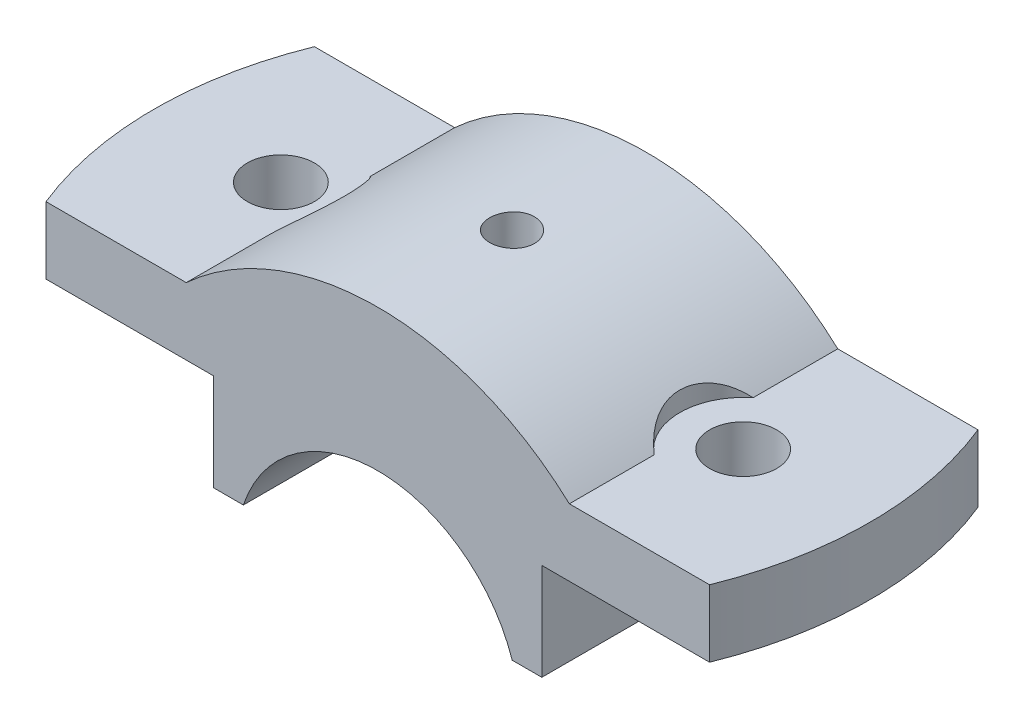
ISO-10303-21;
HEADER;
FILE_DESCRIPTION(('STEP AP214'),'2;1');
FILE_NAME('part.step','',(''),(''),'','','');
FILE_SCHEMA(('AUTOMOTIVE_DESIGN { 1 0 10303 214 1 1 1 1 }'));
ENDSEC;
DATA;
#1=APPLICATION_CONTEXT('core data for automotive mechanical design processes');
#2=APPLICATION_PROTOCOL_DEFINITION('international standard','automotive_design',2000,#1);
#3=PRODUCT_CONTEXT('',#1,'mechanical');
#4=PRODUCT('Part','Part','',(#3));
#5=PRODUCT_RELATED_PRODUCT_CATEGORY('part','',(#4));
#6=PRODUCT_DEFINITION_FORMATION('','',#4);
#7=PRODUCT_DEFINITION_CONTEXT('part definition',#1,'design');
#8=PRODUCT_DEFINITION('design','',#6,#7);
#9=PRODUCT_DEFINITION_SHAPE('','',#8);
#10=(LENGTH_UNIT() NAMED_UNIT(*) SI_UNIT(.MILLI.,.METRE.));
#11=(NAMED_UNIT(*) PLANE_ANGLE_UNIT() SI_UNIT($,.RADIAN.));
#12=(NAMED_UNIT(*) SI_UNIT($,.STERADIAN.) SOLID_ANGLE_UNIT());
#13=UNCERTAINTY_MEASURE_WITH_UNIT(LENGTH_MEASURE(1.E-05),#10,'distance_accuracy_value','');
#14=(GEOMETRIC_REPRESENTATION_CONTEXT(3) GLOBAL_UNCERTAINTY_ASSIGNED_CONTEXT((#13)) GLOBAL_UNIT_ASSIGNED_CONTEXT((#10,
#11,#12)) REPRESENTATION_CONTEXT('',''));
#15=CARTESIAN_POINT('',(0.,0.,0.));
#16=DIRECTION('',(0.,0.,1.));
#17=DIRECTION('',(1.,0.,0.));
#18=AXIS2_PLACEMENT_3D('',#15,#16,#17);
#19=CARTESIAN_POINT('',(0.,0.,18.));
#20=DIRECTION('',(0.,0.,-1.));
#21=DIRECTION('',(-1.,0.,0.));
#22=AXIS2_PLACEMENT_3D('',#19,#20,#21);
#23=CYLINDRICAL_SURFACE('',#22,38.);
#24=CARTESIAN_POINT('',(0.,38.,3.));
#25=CARTESIAN_POINT('',(-0.168230277437706,37.9999984430739,2.99999263868346));
#26=CARTESIAN_POINT('',(-0.336575845655095,37.9988709200709,2.98580169916932));
#27=CARTESIAN_POINT('',(-0.668611397196742,37.9944814128081,2.92939894930333));
#28=CARTESIAN_POINT('',(-0.832295850092009,37.9912169949172,2.88715518982943));
#29=CARTESIAN_POINT('',(-1.15015205512757,37.9829226863334,2.77587406357067));
#30=CARTESIAN_POINT('',(-1.3043290493551,37.9778937789402,2.70685161752221));
#31=CARTESIAN_POINT('',(-1.59887136159142,37.9666348413683,2.54399853963546));
#32=CARTESIAN_POINT('',(-1.73923967362019,37.9604050724332,2.45017330191646));
#33=CARTESIAN_POINT('',(-2.00254103126273,37.9474277075509,2.24014409327318));
#34=CARTESIAN_POINT('',(-2.12543792166293,37.9406790810774,2.1238948563935));
#35=CARTESIAN_POINT('',(-2.34999780988339,37.9274332919605,1.87241281605956));
#36=CARTESIAN_POINT('',(-2.45165988585508,37.9209361402441,1.73717918887838));
#37=CARTESIAN_POINT('',(-2.63098484586302,37.9089176287414,1.45135065682847));
#38=CARTESIAN_POINT('',(-2.708616254697,37.903397552738,1.30073594623714));
#39=CARTESIAN_POINT('',(-2.83747510230931,37.8939696224708,0.988558849059875));
#40=CARTESIAN_POINT('',(-2.8887029645124,37.8900617423529,0.82699663808231));
#41=CARTESIAN_POINT('',(-2.96319644645853,37.8843090780475,0.497870679819642));
#42=CARTESIAN_POINT('',(-2.98652059882487,37.8824599758018,0.33032025735777));
#43=CARTESIAN_POINT('',(-3.00472536931325,37.8810204867557,-0.00632681714998059));
#44=CARTESIAN_POINT('',(-2.99960647157769,37.8814300615093,-0.175423442828303));
#45=CARTESIAN_POINT('',(-2.96111886260011,37.8844577346025,-0.509962310035282));
#46=CARTESIAN_POINT('',(-2.92781369865023,37.8870708648728,-0.675411913710737));
#47=CARTESIAN_POINT('',(-2.83399765916122,37.8942034046858,-0.998365215123264));
#48=CARTESIAN_POINT('',(-2.77348654183749,37.8987228311701,-1.15586884222906));
#49=CARTESIAN_POINT('',(-2.62690490032728,37.9091644380148,-1.45866214971911));
#50=CARTESIAN_POINT('',(-2.54080579129679,37.9150881856644,-1.60393793599879));
#51=CARTESIAN_POINT('',(-2.34551283184452,37.9276694800349,-1.87799978791044));
#52=CARTESIAN_POINT('',(-2.23631856235736,37.9343270400699,-2.0067855542603));
#53=CARTESIAN_POINT('',(-1.99757813910437,37.947647885739,-2.24458115896057));
#54=CARTESIAN_POINT('',(-1.86797703439473,37.9543111370687,-2.35353583758634));
#55=CARTESIAN_POINT('',(-1.59229376436976,37.9668751419437,-2.54815019879117));
#56=CARTESIAN_POINT('',(-1.44621158946688,37.9727758950454,-2.63380986781872));
#57=CARTESIAN_POINT('',(-1.14167761997913,37.983150993084,-2.77939892547026));
#58=CARTESIAN_POINT('',(-0.983224692335488,37.9876252071703,-2.83932595392176));
#59=CARTESIAN_POINT('',(-0.658463212690176,37.9946415451888,-2.93171041942903));
#60=CARTESIAN_POINT('',(-0.492154807064346,37.997183705107,-2.96416836811962));
#61=CARTESIAN_POINT('',(-0.156881478742684,38.0000448768352,-3.00062434440681));
#62=CARTESIAN_POINT('',(0.0120751089608384,38.0003698415183,-3.00469857910482));
#63=CARTESIAN_POINT('',(0.348269003373999,37.9987758913175,-2.98447098943403));
#64=CARTESIAN_POINT('',(0.515506324442484,37.9968569951891,-2.96016940224689));
#65=CARTESIAN_POINT('',(0.843297753735755,37.9909950041868,-2.88394314979588));
#66=CARTESIAN_POINT('',(1.00386010671882,37.987054491835,-2.83205372367032));
#67=CARTESIAN_POINT('',(1.31399900365979,37.9775920824189,-2.70216068710782));
#68=CARTESIAN_POINT('',(1.46357539119334,37.9720701628431,-2.62415670492505));
#69=CARTESIAN_POINT('',(1.74784375041781,37.9600494395666,-2.44405671040129));
#70=CARTESIAN_POINT('',(1.88250358772923,37.953548595394,-2.34191011569745));
#71=CARTESIAN_POINT('',(2.13279217984117,37.9403075453845,-2.11649766051109));
#72=CARTESIAN_POINT('',(2.24842063776818,37.9335673358158,-1.99323147064187));
#73=CARTESIAN_POINT('',(2.45762484975141,37.9205896766453,-1.72874864835165));
#74=CARTESIAN_POINT('',(2.55115094155127,37.9143533795853,-1.58749266904679));
#75=CARTESIAN_POINT('',(2.713155238272,37.9031055627809,-1.29123629441747));
#76=CARTESIAN_POINT('',(2.78163367119924,37.8980940318878,-1.13623602422189));
#77=CARTESIAN_POINT('',(2.89151387110069,37.8898693720601,-0.817068099787168));
#78=CARTESIAN_POINT('',(2.93294623887224,37.8866542112497,-0.652911034998947));
#79=CARTESIAN_POINT('',(2.98765790023766,37.8823793491511,-0.319943850373173));
#80=CARTESIAN_POINT('',(3.00093767292138,37.8813196111828,-0.151133809767669));
#81=CARTESIAN_POINT('',(2.99896188688675,37.8814760426207,0.185853858942922));
#82=CARTESIAN_POINT('',(2.98378436644711,37.8826859878913,0.354031953001599));
#83=CARTESIAN_POINT('',(2.92548733876923,37.887232237977,0.68544287301911));
#84=CARTESIAN_POINT('',(2.8823677867555,37.8905685461995,0.848675691052988));
#85=CARTESIAN_POINT('',(2.7694300101543,37.8989899804525,1.16556899687011));
#86=CARTESIAN_POINT('',(2.69961296444521,37.9040750292632,1.31922990697071));
#87=CARTESIAN_POINT('',(2.535271096382,37.9154210711218,1.61266178094886));
#88=CARTESIAN_POINT('',(2.44074672054794,37.9216820429175,1.75243299578316));
#89=CARTESIAN_POINT('',(2.22938062382269,37.9346948182221,2.01451680288399));
#90=CARTESIAN_POINT('',(2.11248130954251,37.941447859921,2.13678288515433));
#91=CARTESIAN_POINT('',(1.85978424897896,37.954672635902,2.36000556130417));
#92=CARTESIAN_POINT('',(1.72398192526551,37.9611443015481,2.46095697881558));
#93=CARTESIAN_POINT('',(1.43709756450133,37.9730876131211,2.63880542567551));
#94=CARTESIAN_POINT('',(1.2859897583193,37.978557527474,2.71566096437293));
#95=CARTESIAN_POINT('',(0.973076064569829,37.9878601967286,2.8428120018995));
#96=CARTESIAN_POINT('',(0.811282773093929,37.9916948408735,2.89313816633252));
#97=CARTESIAN_POINT('',(0.540438770546244,37.9963056825779,2.95292296572034));
#98=CARTESIAN_POINT('',(0.433132098217287,37.9976847801056,2.97055353917028));
#99=CARTESIAN_POINT('',(0.217232975456249,37.9995324404705,2.99409441950641));
#100=CARTESIAN_POINT('',(0.108640528034262,38.0000010054389,3.0000047538251));
#101=CARTESIAN_POINT('',(0.,38.,3.));
#102=B_SPLINE_CURVE_WITH_KNOTS('',3,(#24,#25,#26,#27,#28,#29,#30,#31,#32,#33,#34,#35,#36,#37,
#38,#39,#40,#41,#42,#43,#44,#45,#46,#47,#48,#49,#50,#51,#52,#53,#54,#55,#56,#57,#58,#59,#60,#61,
#62,#63,#64,#65,#66,#67,#68,#69,#70,#71,#72,#73,#74,#75,#76,#77,#78,#79,#80,#81,#82,#83,#84,#85,
#86,#87,#88,#89,#90,#91,#92,#93,#94,#95,#96,#97,#98,#99,#100,#101),.UNSPECIFIED.,.T.,.F.,(4,2,2,
2,2,2,2,2,2,2,2,2,2,2,2,2,2,2,2,2,2,2,2,2,2,2,2,2,2,2,2,2,2,2,2,2,2,2,4),(0.,0.504294188546741,
1.00916370078726,1.51375230936014,2.01823126998903,2.5237394549149,3.0292695804704,
3.53545907123702,4.04164044416132,4.54675814609821,5.05186725021795,5.55584058602808,
6.05981840083593,6.56436134901272,7.06891345298728,7.57484819748388,8.0807832362998,
8.58676466907349,9.09273667730812,9.59734968185781,10.1019584685879,10.6059242398502,
11.1098971854695,11.614935538604,12.1199817691652,12.6261522324058,13.1323180879118,
13.6379102536977,14.1434938154447,14.6476929456065,15.1518928837201,15.6560705605014,
16.1602391262259,16.6657233184336,17.1713301290485,17.6778028214878,18.183688785524,
18.5093549854356,18.8350204230892),.UNSPECIFIED.);
#103=CARTESIAN_POINT('',(0.,38.,3.));
#104=VERTEX_POINT('',#103);
#105=EDGE_CURVE('E11',#104,#104,#102,.T.);
#106=ORIENTED_EDGE('',*,*,#105,.T.);
#107=EDGE_LOOP('',(#106));
#108=FACE_BOUND('',#107,.T.);
#109=DIRECTION('',(0.,0.,-1.));
#110=VECTOR('',#109,1.);
#111=CARTESIAN_POINT('',(25.6904651573303,28.,18.));
#112=LINE('',#111,#110);
#113=CARTESIAN_POINT('',(25.6904651573303,28.,18.));
#114=VERTEX_POINT('',#113);
#115=CARTESIAN_POINT('',(25.6904651573303,28.,6.6376833123068));
#116=VERTEX_POINT('',#115);
#117=EDGE_CURVE('E148',#114,#116,#112,.T.);
#118=ORIENTED_EDGE('',*,*,#117,.T.);
#119=CARTESIAN_POINT('',(25.6904651573303,28.,6.63768331230679));
#120=CARTESIAN_POINT('',(25.5360851043424,28.1416681018721,6.51420867249737));
#121=CARTESIAN_POINT('',(25.3836215551735,28.2791823336498,6.38340380017068));
#122=CARTESIAN_POINT('',(25.0841053598261,28.5451833866574,6.10685950724571));
#123=CARTESIAN_POINT('',(24.9370580895264,28.6736613482156,5.96110576476093));
#124=CARTESIAN_POINT('',(24.6491941230388,28.9215085426632,5.653491442262));
#125=CARTESIAN_POINT('',(24.508431723833,29.0408031542341,5.49151942353939));
#126=CARTESIAN_POINT('',(24.2363075607749,29.2682904084011,5.15263687836669));
#127=CARTESIAN_POINT('',(24.1049430857226,29.3764862568107,4.97573069263072));
#128=CARTESIAN_POINT('',(23.8528205053459,29.5815743674557,4.60631493821573));
#129=CARTESIAN_POINT('',(23.7321338833277,29.6783916917415,4.41371469093335));
#130=CARTESIAN_POINT('',(23.5043908446779,29.85908164754,4.01479632179465));
#131=CARTESIAN_POINT('',(23.3973358972541,29.942952883943,3.8084767249227));
#132=CARTESIAN_POINT('',(23.1992536300817,30.0966827286364,3.38422419101505));
#133=CARTESIAN_POINT('',(23.1081729651955,30.1665880882949,3.16633319991271));
#134=CARTESIAN_POINT('',(22.9434688496595,30.2920447623401,2.72008092153075));
#135=CARTESIAN_POINT('',(22.869842066784,30.347598816803,2.49172164276594));
#136=CARTESIAN_POINT('',(22.7499342032063,30.4375648556656,2.05682098381957));
#137=CARTESIAN_POINT('',(22.7013462567531,30.4737833576563,1.85128534823192));
#138=CARTESIAN_POINT('',(22.6194172898017,30.534645499234,1.43551725204116));
#139=CARTESIAN_POINT('',(22.5860747992536,30.5592902548309,1.22528524633892));
#140=CARTESIAN_POINT('',(22.5352129551669,30.5968164834569,0.801799591498537));
#141=CARTESIAN_POINT('',(22.5176992505084,30.6096937569973,0.588544891193931));
#142=CARTESIAN_POINT('',(22.4988301660851,30.6235658271181,0.160939560666244));
#143=CARTESIAN_POINT('',(22.4974739036633,30.624561272785,-0.0534110090511235));
#144=CARTESIAN_POINT('',(22.5103301119086,30.6151119876343,-0.46199747981814));
#145=CARTESIAN_POINT('',(22.5231488228924,30.6056914251709,-0.656303160135766));
#146=CARTESIAN_POINT('',(22.5619809221014,30.5770763766543,-1.0428625929884));
#147=CARTESIAN_POINT('',(22.5879939672906,30.5578821447042,-1.23511639873687));
#148=CARTESIAN_POINT('',(22.6528192304938,30.5098574663833,-1.61613906729808));
#149=CARTESIAN_POINT('',(22.6916259266854,30.4810311771979,-1.80490939654948));
#150=CARTESIAN_POINT('',(22.7814851533843,30.4139289484325,-2.17779604427593));
#151=CARTESIAN_POINT('',(22.8325379785097,30.3756527815061,-2.36191225066402));
#152=CARTESIAN_POINT('',(22.9463727274414,30.2897519777021,-2.72495933677602));
#153=CARTESIAN_POINT('',(23.0091940590921,30.2420959034169,-2.90387039063446));
#154=CARTESIAN_POINT('',(23.1456283742011,30.1378044455698,-3.25489148863349));
#155=CARTESIAN_POINT('',(23.2192449894415,30.0811660396201,-3.42699921914349));
#156=CARTESIAN_POINT('',(23.3763137314078,29.9592695660632,-3.76349373210636));
#157=CARTESIAN_POINT('',(23.4597660818508,29.8940113023904,-3.92788033882065));
#158=CARTESIAN_POINT('',(23.635527045378,29.7552415450916,-4.24828704232642));
#159=CARTESIAN_POINT('',(23.7278387953854,29.6817271265587,-4.40430414494655));
#160=CARTESIAN_POINT('',(23.9282386479047,29.5204551498758,-4.71995510834891));
#161=CARTESIAN_POINT('',(24.0370002176616,29.432022004933,-4.87881602386905));
#162=CARTESIAN_POINT('',(24.2623844714665,29.2465042091278,-5.1856332961988));
#163=CARTESIAN_POINT('',(24.379010630913,29.1494157272481,-5.33358477081362));
#164=CARTESIAN_POINT('',(24.6187042069683,28.9472618083659,-5.61815393006346));
#165=CARTESIAN_POINT('',(24.7417672458198,28.8422017715012,-5.75477915839727));
#166=CARTESIAN_POINT('',(24.9931857635632,28.6246099475779,-6.016738259449));
#167=CARTESIAN_POINT('',(25.121541230047,28.5120781780363,-6.14207215863704));
#168=CARTESIAN_POINT('',(25.3239635142993,28.3320696328102,-6.32788833390874));
#169=CARTESIAN_POINT('',(25.3966039536003,28.2669811541268,-6.39227987552885));
#170=CARTESIAN_POINT('',(25.5428336292653,28.1349133065772,-6.5175597465675));
#171=CARTESIAN_POINT('',(25.6164208573994,28.0679376662269,-6.57845434819236));
#172=CARTESIAN_POINT('',(25.6904651573302,28.0000000000002,-6.63768331230706));
#173=B_SPLINE_CURVE_WITH_KNOTS('',3,(#119,#120,#121,#122,#123,#124,#125,#126,#127,#128,#129,
#130,#131,#132,#133,#134,#135,#136,#137,#138,#139,#140,#141,#142,#143,#144,#145,#146,#147,#148,
#149,#150,#151,#152,#153,#154,#155,#156,#157,#158,#159,#160,#161,#162,#163,#164,#165,#166,#167,
#168,#169,#170,#171,#172),.UNSPECIFIED.,.F.,.F.,(4,2,2,2,2,2,2,2,2,2,2,2,2,2,2,2,2,2,2,2,2,2,2,
2,2,2,4),(0.,0.729592400834073,1.45989044138352,2.19560470883999,2.93110586753775,
3.67120763552798,4.41138910352643,5.14904966030397,5.8865692722368,6.52855006409985,
7.17046893961489,7.8126168088522,8.45472959834446,9.03890309081732,9.62306139629814,
10.2069679046447,10.7908884620571,11.3768004587137,11.9629100238154,12.549032922753,
13.1353641263273,13.7703169673958,14.4055522594533,15.040361004022,15.6751682603777,
16.0257258218313,16.3756336015193),.UNSPECIFIED.);
#174=CARTESIAN_POINT('',(25.6904651573303,28.,-6.6376833123068));
#175=VERTEX_POINT('',#174);
#176=EDGE_CURVE('E140',#116,#175,#173,.T.);
#177=ORIENTED_EDGE('',*,*,#176,.T.);
#178=CARTESIAN_POINT('',(25.6904651573303,28.,-18.));
#179=VERTEX_POINT('',#178);
#180=EDGE_CURVE('E145',#175,#179,#112,.T.);
#181=ORIENTED_EDGE('',*,*,#180,.T.);
#182=CARTESIAN_POINT('',(0.,0.,-18.));
#183=DIRECTION('',(0.,0.,1.));
#184=DIRECTION('',(1.,0.,0.));
#185=AXIS2_PLACEMENT_3D('',#182,#183,#184);
#186=CIRCLE('',#185,38.);
#187=CARTESIAN_POINT('',(-25.6904651573303,28.,-18.));
#188=VERTEX_POINT('',#187);
#189=EDGE_CURVE('E249',#179,#188,#186,.T.);
#190=ORIENTED_EDGE('',*,*,#189,.T.);
#191=DIRECTION('',(0.,0.,-1.));
#192=VECTOR('',#191,1.);
#193=CARTESIAN_POINT('',(-25.6904651573303,28.,18.));
#194=LINE('',#193,#192);
#195=CARTESIAN_POINT('',(-25.6904651573303,28.,-6.63768331230679));
#196=VERTEX_POINT('',#195);
#197=EDGE_CURVE('E182',#196,#188,#194,.T.);
#198=ORIENTED_EDGE('',*,*,#197,.F.);
#199=CARTESIAN_POINT('',(-25.6904651573303,28.,6.63768331230679));
#200=CARTESIAN_POINT('',(-25.5360851043424,28.1416681018721,6.51420867249737));
#201=CARTESIAN_POINT('',(-25.3836215551735,28.2791823336498,6.38340380017068));
#202=CARTESIAN_POINT('',(-25.0841053598261,28.5451833866574,6.10685950724571));
#203=CARTESIAN_POINT('',(-24.9370580895264,28.6736613482156,5.96110576476093));
#204=CARTESIAN_POINT('',(-24.6491941230388,28.9215085426632,5.653491442262));
#205=CARTESIAN_POINT('',(-24.508431723833,29.0408031542341,5.49151942353939));
#206=CARTESIAN_POINT('',(-24.2363075607749,29.2682904084011,5.1526368783667));
#207=CARTESIAN_POINT('',(-24.1049430857226,29.3764862568107,4.97573069263072));
#208=CARTESIAN_POINT('',(-23.8528205053459,29.5815743674557,4.60631493821573));
#209=CARTESIAN_POINT('',(-23.7321338833277,29.6783916917415,4.41371469093334));
#210=CARTESIAN_POINT('',(-23.5043908446779,29.85908164754,4.01479632179465));
#211=CARTESIAN_POINT('',(-23.3973358972541,29.942952883943,3.8084767249227));
#212=CARTESIAN_POINT('',(-23.1992536300817,30.0966827286364,3.38422419101505));
#213=CARTESIAN_POINT('',(-23.1081729651955,30.1665880882949,3.16633319991271));
#214=CARTESIAN_POINT('',(-22.9434688496595,30.2920447623401,2.72008092153075));
#215=CARTESIAN_POINT('',(-22.869842066784,30.347598816803,2.49172164276594));
#216=CARTESIAN_POINT('',(-22.7499342032063,30.4375648556656,2.05682098381957));
#217=CARTESIAN_POINT('',(-22.7013462567531,30.4737833576563,1.85128534823192));
#218=CARTESIAN_POINT('',(-22.6194172898017,30.534645499234,1.43551725204116));
#219=CARTESIAN_POINT('',(-22.5860747992536,30.5592902548309,1.22528524633892));
#220=CARTESIAN_POINT('',(-22.5352129551669,30.5968164834569,0.801799591498539));
#221=CARTESIAN_POINT('',(-22.5176992505084,30.6096937569973,0.588544891193933));
#222=CARTESIAN_POINT('',(-22.4988301660851,30.6235658271181,0.160939560666246));
#223=CARTESIAN_POINT('',(-22.4974739036633,30.624561272785,-0.0534110090511212));
#224=CARTESIAN_POINT('',(-22.5103301119086,30.6151119876343,-0.461997479818138));
#225=CARTESIAN_POINT('',(-22.5231488228924,30.6056914251709,-0.656303160135765));
#226=CARTESIAN_POINT('',(-22.5619809221014,30.5770763766543,-1.0428625929884));
#227=CARTESIAN_POINT('',(-22.5879939672906,30.5578821447042,-1.23511639873687));
#228=CARTESIAN_POINT('',(-22.6528192304938,30.5098574663833,-1.61613906729808));
#229=CARTESIAN_POINT('',(-22.6916259266854,30.4810311771979,-1.80490939654947));
#230=CARTESIAN_POINT('',(-22.7814851533843,30.4139289484325,-2.17779604427593));
#231=CARTESIAN_POINT('',(-22.8325379785097,30.3756527815061,-2.36191225066402));
#232=CARTESIAN_POINT('',(-22.9463727274414,30.2897519777021,-2.72495933677602));
#233=CARTESIAN_POINT('',(-23.0091940590921,30.2420959034169,-2.90387039063446));
#234=CARTESIAN_POINT('',(-23.1456283742011,30.1378044455698,-3.25489148863349));
#235=CARTESIAN_POINT('',(-23.2192449894415,30.0811660396201,-3.42699921914349));
#236=CARTESIAN_POINT('',(-23.3763137314078,29.9592695660632,-3.76349373210635));
#237=CARTESIAN_POINT('',(-23.4597660818508,29.8940113023904,-3.92788033882065));
#238=CARTESIAN_POINT('',(-23.635527045378,29.7552415450916,-4.24828704232642));
#239=CARTESIAN_POINT('',(-23.7278387953854,29.6817271265587,-4.40430414494654));
#240=CARTESIAN_POINT('',(-23.9282386479047,29.5204551498758,-4.71995510834891));
#241=CARTESIAN_POINT('',(-24.0370002176616,29.432022004933,-4.87881602386905));
#242=CARTESIAN_POINT('',(-24.2623844714665,29.2465042091278,-5.18563329619879));
#243=CARTESIAN_POINT('',(-24.379010630913,29.1494157272481,-5.33358477081362));
#244=CARTESIAN_POINT('',(-24.6187042069683,28.9472618083659,-5.61815393006346));
#245=CARTESIAN_POINT('',(-24.7417672458198,28.8422017715012,-5.75477915839727));
#246=CARTESIAN_POINT('',(-24.9931857635632,28.6246099475779,-6.01673825944899));
#247=CARTESIAN_POINT('',(-25.121541230047,28.5120781780363,-6.14207215863704));
#248=CARTESIAN_POINT('',(-25.3239635142993,28.3320696328102,-6.32788833390874));
#249=CARTESIAN_POINT('',(-25.3966039536003,28.2669811541268,-6.39227987552885));
#250=CARTESIAN_POINT('',(-25.5428336292653,28.1349133065772,-6.5175597465675));
#251=CARTESIAN_POINT('',(-25.6164208573994,28.0679376662269,-6.57845434819236));
#252=CARTESIAN_POINT('',(-25.6904651573302,28.0000000000002,-6.63768331230706));
#253=B_SPLINE_CURVE_WITH_KNOTS('',3,(#199,#200,#201,#202,#203,#204,#205,#206,#207,#208,#209,
#210,#211,#212,#213,#214,#215,#216,#217,#218,#219,#220,#221,#222,#223,#224,#225,#226,#227,#228,
#229,#230,#231,#232,#233,#234,#235,#236,#237,#238,#239,#240,#241,#242,#243,#244,#245,#246,#247,
#248,#249,#250,#251,#252),.UNSPECIFIED.,.F.,.F.,(4,2,2,2,2,2,2,2,2,2,2,2,2,2,2,2,2,2,2,2,2,2,2,
2,2,2,4),(0.,0.729592400834073,1.45989044138352,2.19560470883998,2.93110586753775,
3.67120763552798,4.41138910352643,5.14904966030397,5.8865692722368,6.52855006409984,
7.17046893961489,7.8126168088522,8.45472959834445,9.03890309081732,9.62306139629814,
10.2069679046447,10.7908884620571,11.3768004587137,11.9629100238154,12.549032922753,
13.1353641263273,13.7703169673958,14.4055522594533,15.040361004022,15.6751682603777,
16.0257258218313,16.3756336015193),.UNSPECIFIED.);
#254=CARTESIAN_POINT('',(-25.6904651573303,28.,6.63768331230679));
#255=VERTEX_POINT('',#254);
#256=EDGE_CURVE('E220',#255,#196,#253,.T.);
#257=ORIENTED_EDGE('',*,*,#256,.F.);
#258=CARTESIAN_POINT('',(-25.6904651573303,28.,18.));
#259=VERTEX_POINT('',#258);
#260=EDGE_CURVE('E183',#259,#255,#194,.T.);
#261=ORIENTED_EDGE('',*,*,#260,.F.);
#262=CARTESIAN_POINT('',(0.,0.,18.));
#263=DIRECTION('',(0.,0.,1.));
#264=DIRECTION('',(1.,0.,0.));
#265=AXIS2_PLACEMENT_3D('',#262,#263,#264);
#266=CIRCLE('',#265,38.);
#267=EDGE_CURVE('E250',#114,#259,#266,.T.);
#268=ORIENTED_EDGE('',*,*,#267,.F.);
#269=EDGE_LOOP('',(#118,#177,#181,#190,#198,#257,#261,#268));
#270=FACE_BOUND('',#269,.T.);
#271=ADVANCED_FACE('F33',(#108,#270),#23,.T.);
#272=CARTESIAN_POINT('',(-50.,28.,18.));
#273=DIRECTION('',(0.,-1.,0.));
#274=DIRECTION('',(1.,0.,0.));
#275=AXIS2_PLACEMENT_3D('',#272,#273,#274);
#276=PLANE('',#275);
#277=ORIENTED_EDGE('',*,*,#260,.T.);
#278=CARTESIAN_POINT('',(-31.,28.,0.));
#279=DIRECTION('',(0.,1.,0.));
#280=DIRECTION('',(-1.,0.,0.));
#281=AXIS2_PLACEMENT_3D('',#278,#279,#280);
#282=CIRCLE('',#281,8.5);
#283=EDGE_CURVE('E61',#255,#196,#282,.T.);
#284=ORIENTED_EDGE('',*,*,#283,.T.);
#285=ORIENTED_EDGE('',*,*,#197,.T.);
#286=DIRECTION('',(-1.,0.,0.));
#287=VECTOR('',#286,1.);
#288=CARTESIAN_POINT('',(-50.,28.,-18.));
#289=LINE('',#288,#287);
#290=CARTESIAN_POINT('',(-44.497190922574,28.,-18.));
#291=VERTEX_POINT('',#290);
#292=EDGE_CURVE('E271',#188,#291,#289,.T.);
#293=ORIENTED_EDGE('',*,*,#292,.T.);
#294=CARTESIAN_POINT('',(0.,28.,0.));
#295=DIRECTION('',(0.,-1.,0.));
#296=DIRECTION('',(-1.,0.,0.));
#297=AXIS2_PLACEMENT_3D('',#294,#295,#296);
#298=CIRCLE('',#297,48.);
#299=CARTESIAN_POINT('',(-44.497190922574,28.,18.));
#300=VERTEX_POINT('',#299);
#301=EDGE_CURVE('E242',#300,#291,#298,.T.);
#302=ORIENTED_EDGE('',*,*,#301,.F.);
#303=DIRECTION('',(-1.,0.,0.));
#304=VECTOR('',#303,1.);
#305=CARTESIAN_POINT('',(-50.,28.,18.));
#306=LINE('',#305,#304);
#307=EDGE_CURVE('E253',#259,#300,#306,.T.);
#308=ORIENTED_EDGE('',*,*,#307,.F.);
#309=EDGE_LOOP('',(#277,#284,#285,#293,#302,#308));
#310=FACE_BOUND('',#309,.T.);
#311=CARTESIAN_POINT('',(-31.,28.,0.));
#312=DIRECTION('',(0.,1.,0.));
#313=DIRECTION('',(-1.,0.,0.));
#314=AXIS2_PLACEMENT_3D('',#311,#312,#313);
#315=CIRCLE('',#314,4.5);
#316=CARTESIAN_POINT('',(-35.5,28.,0.));
#317=VERTEX_POINT('',#316);
#318=EDGE_CURVE('E193',#317,#317,#315,.T.);
#319=ORIENTED_EDGE('',*,*,#318,.F.);
#320=EDGE_LOOP('',(#319));
#321=FACE_BOUND('',#320,.T.);
#322=ADVANCED_FACE('F334',(#310,#321),#276,.F.);
#323=CARTESIAN_POINT('',(-22.,19.,18.));
#324=DIRECTION('',(0.,1.,0.));
#325=DIRECTION('',(-1.,0.,0.));
#326=AXIS2_PLACEMENT_3D('',#323,#324,#325);
#327=PLANE('',#326);
#328=CARTESIAN_POINT('',(-31.,19.,0.));
#329=DIRECTION('',(0.,1.,0.));
#330=DIRECTION('',(-1.,0.,0.));
#331=AXIS2_PLACEMENT_3D('',#328,#329,#330);
#332=CIRCLE('',#331,4.5);
#333=CARTESIAN_POINT('',(-35.5,19.,0.));
#334=VERTEX_POINT('',#333);
#335=EDGE_CURVE('E190',#334,#334,#332,.T.);
#336=ORIENTED_EDGE('',*,*,#335,.T.);
#337=EDGE_LOOP('',(#336));
#338=FACE_BOUND('',#337,.T.);
#339=DIRECTION('',(1.,0.,0.));
#340=VECTOR('',#339,1.);
#341=CARTESIAN_POINT('',(-22.,19.,18.));
#342=LINE('',#341,#340);
#343=CARTESIAN_POINT('',(-44.497190922574,19.,18.));
#344=VERTEX_POINT('',#343);
#345=CARTESIAN_POINT('',(-22.,19.,18.));
#346=VERTEX_POINT('',#345);
#347=EDGE_CURVE('E256',#344,#346,#342,.T.);
#348=ORIENTED_EDGE('',*,*,#347,.F.);
#349=CARTESIAN_POINT('',(0.,19.,0.));
#350=DIRECTION('',(0.,1.,0.));
#351=DIRECTION('',(-1.,0.,0.));
#352=AXIS2_PLACEMENT_3D('',#349,#350,#351);
#353=CIRCLE('',#352,48.);
#354=CARTESIAN_POINT('',(-44.497190922574,19.,-18.));
#355=VERTEX_POINT('',#354);
#356=EDGE_CURVE('E246',#344,#355,#353,.F.);
#357=ORIENTED_EDGE('',*,*,#356,.T.);
#358=DIRECTION('',(1.,0.,0.));
#359=VECTOR('',#358,1.);
#360=CARTESIAN_POINT('',(-22.,19.,-18.));
#361=LINE('',#360,#359);
#362=CARTESIAN_POINT('',(-22.,19.,-18.));
#363=VERTEX_POINT('',#362);
#364=EDGE_CURVE('E274',#355,#363,#361,.T.);
#365=ORIENTED_EDGE('',*,*,#364,.T.);
#366=DIRECTION('',(0.,0.,-1.));
#367=VECTOR('',#366,1.);
#368=CARTESIAN_POINT('',(-22.,19.,18.));
#369=LINE('',#368,#367);
#370=EDGE_CURVE('E179',#346,#363,#369,.T.);
#371=ORIENTED_EDGE('',*,*,#370,.F.);
#372=EDGE_LOOP('',(#348,#357,#365,#371));
#373=FACE_BOUND('',#372,.T.);
#374=ADVANCED_FACE('F329',(#338,#373),#327,.F.);
#375=CARTESIAN_POINT('',(-22.,5.99999999999999,18.));
#376=DIRECTION('',(1.,0.,0.));
#377=DIRECTION('',(0.,0.,-1.));
#378=AXIS2_PLACEMENT_3D('',#375,#376,#377);
#379=PLANE('',#378);
#380=DIRECTION('',(0.,-1.,0.));
#381=VECTOR('',#380,1.);
#382=CARTESIAN_POINT('',(-22.,5.99999999999999,-18.));
#383=LINE('',#382,#381);
#384=CARTESIAN_POINT('',(-22.,5.99999999999999,-18.));
#385=VERTEX_POINT('',#384);
#386=EDGE_CURVE('E276',#363,#385,#383,.T.);
#387=ORIENTED_EDGE('',*,*,#386,.T.);
#388=DIRECTION('',(0.,0.,-1.));
#389=VECTOR('',#388,1.);
#390=CARTESIAN_POINT('',(-22.,5.99999999999999,18.));
#391=LINE('',#390,#389);
#392=CARTESIAN_POINT('',(-22.,5.99999999999999,18.));
#393=VERTEX_POINT('',#392);
#394=EDGE_CURVE('E176',#393,#385,#391,.T.);
#395=ORIENTED_EDGE('',*,*,#394,.F.);
#396=DIRECTION('',(0.,-1.,0.));
#397=VECTOR('',#396,1.);
#398=CARTESIAN_POINT('',(-22.,5.99999999999999,18.));
#399=LINE('',#398,#397);
#400=EDGE_CURVE('E258',#346,#393,#399,.T.);
#401=ORIENTED_EDGE('',*,*,#400,.F.);
#402=ORIENTED_EDGE('',*,*,#370,.T.);
#403=EDGE_LOOP('',(#387,#395,#401,#402));
#404=FACE_BOUND('',#403,.T.);
#405=ADVANCED_FACE('F323',(#404),#379,.F.);
#406=CARTESIAN_POINT('',(-22.,5.99999999999999,18.));
#407=DIRECTION('',(0.,1.,0.));
#408=DIRECTION('',(-1.,0.,0.));
#409=AXIS2_PLACEMENT_3D('',#406,#407,#408);
#410=PLANE('',#409);
#411=DIRECTION('',(1.,0.,0.));
#412=VECTOR('',#411,1.);
#413=CARTESIAN_POINT('',(-22.,5.99999999999999,-18.));
#414=LINE('',#413,#412);
#415=CARTESIAN_POINT('',(-18.0277563773199,6.,-18.));
#416=VERTEX_POINT('',#415);
#417=EDGE_CURVE('E278',#385,#416,#414,.T.);
#418=ORIENTED_EDGE('',*,*,#417,.T.);
#419=DIRECTION('',(0.,0.,-1.));
#420=VECTOR('',#419,1.);
#421=CARTESIAN_POINT('',(-18.0277563773199,6.,18.));
#422=LINE('',#421,#420);
#423=CARTESIAN_POINT('',(-18.0277563773199,6.,18.));
#424=VERTEX_POINT('',#423);
#425=EDGE_CURVE('E173',#424,#416,#422,.T.);
#426=ORIENTED_EDGE('',*,*,#425,.F.);
#427=DIRECTION('',(1.,0.,0.));
#428=VECTOR('',#427,1.);
#429=CARTESIAN_POINT('',(-22.,5.99999999999999,18.));
#430=LINE('',#429,#428);
#431=EDGE_CURVE('E260',#393,#424,#430,.T.);
#432=ORIENTED_EDGE('',*,*,#431,.F.);
#433=ORIENTED_EDGE('',*,*,#394,.T.);
#434=EDGE_LOOP('',(#418,#426,#432,#433));
#435=FACE_BOUND('',#434,.T.);
#436=ADVANCED_FACE('F319',(#435),#410,.F.);
#437=CARTESIAN_POINT('',(0.,0.,18.));
#438=DIRECTION('',(0.,0.,-1.));
#439=DIRECTION('',(-1.,0.,0.));
#440=AXIS2_PLACEMENT_3D('',#437,#438,#439);
#441=CYLINDRICAL_SURFACE('',#440,19.);
#442=CARTESIAN_POINT('',(0.,19.,2.49999999999999));
#443=CARTESIAN_POINT('',(0.139778315489381,18.999997967774,2.49999410094607));
#444=CARTESIAN_POINT('',(0.279642447495432,18.9984412683557,2.48823767475851));
#445=CARTESIAN_POINT('',(0.555474474016764,18.9923810422329,2.44152700403634));
#446=CARTESIAN_POINT('',(0.691438217949602,18.9878744896332,2.40654893872552));
#447=CARTESIAN_POINT('',(0.955436642925262,18.9764219373405,2.31444705906101));
#448=CARTESIAN_POINT('',(1.08347675216936,18.9694776299244,2.25733860465933));
#449=CARTESIAN_POINT('',(1.32813277832855,18.9539206812215,2.12263165454414));
#450=CARTESIAN_POINT('',(1.44475055826477,18.9453083126858,2.04503650793576));
#451=CARTESIAN_POINT('',(1.66398308687909,18.9273173646443,1.87105538112386));
#452=CARTESIAN_POINT('',(1.76651843289981,18.9179348817316,1.77456973952705));
#453=CARTESIAN_POINT('',(1.95399133146886,18.8994924119599,1.56576064733009));
#454=CARTESIAN_POINT('',(2.0389279601093,18.890432442053,1.4534363657436));
#455=CARTESIAN_POINT('',(2.18909162338547,18.8736225658863,1.21561789849417));
#456=CARTESIAN_POINT('',(2.254243636291,18.8658776941045,1.09007595594652));
#457=CARTESIAN_POINT('',(2.36250946256607,18.8526269269547,0.82971330966885));
#458=CARTESIAN_POINT('',(2.40562420041089,18.8471209376663,0.694892995440666));
#459=CARTESIAN_POINT('',(2.46834893112872,18.8390089488849,0.420627771177584));
#460=CARTESIAN_POINT('',(2.48809350572304,18.8363863510935,0.281214139706503));
#461=CARTESIAN_POINT('',(2.50393399543624,18.8342874081065,0.0010294214537408));
#462=CARTESIAN_POINT('',(2.50003096100306,18.8348109231579,-0.139741604753913));
#463=CARTESIAN_POINT('',(2.46879737750757,18.8389298660036,-0.417704097944482));
#464=CARTESIAN_POINT('',(2.44161547626707,18.8425058020086,-0.554912597936804));
#465=CARTESIAN_POINT('',(2.36482786882149,18.852296258763,-0.822803762753464));
#466=CARTESIAN_POINT('',(2.31522166359116,18.8585108382319,-0.95348628227828));
#467=CARTESIAN_POINT('',(2.19483509097755,18.8729003199956,-1.20507533515602));
#468=CARTESIAN_POINT('',(2.12399053069557,18.8810811502029,-1.3259507990106));
#469=CARTESIAN_POINT('',(1.96318413435717,18.8984768576706,-1.55415393130079));
#470=CARTESIAN_POINT('',(1.87322133002782,18.9076917872934,-1.66148091311362));
#471=CARTESIAN_POINT('',(1.67591027855668,18.9262039286229,-1.8604029509214));
#472=CARTESIAN_POINT('',(1.5684339827901,18.9355012293485,-1.95187103488117));
#473=CARTESIAN_POINT('',(1.33958658891131,18.9530645440151,-2.11548884034055));
#474=CARTESIAN_POINT('',(1.21821545257772,18.9613305551191,-2.18763850869799));
#475=CARTESIAN_POINT('',(0.964922757293814,18.9759058695861,-2.31057308687671));
#476=CARTESIAN_POINT('',(0.832997072631037,18.9822144030351,-2.36134959301125));
#477=CARTESIAN_POINT('',(0.562390331231886,18.9921571388022,-2.43999334343768));
#478=CARTESIAN_POINT('',(0.423709625549348,18.9957914799383,-2.4678617769038));
#479=CARTESIAN_POINT('',(0.144626841595052,18.9999582136113,-2.49973268466772));
#480=CARTESIAN_POINT('',(0.00424505397900282,19.0005133278906,-2.50390998199236));
#481=CARTESIAN_POINT('',(-0.275216665266614,18.9985205333266,-2.48874205734629));
#482=CARTESIAN_POINT('',(-0.414296627611643,18.9959726978817,-2.46939739177319));
#483=CARTESIAN_POINT('',(-0.686687509149987,18.9880744020358,-2.40787994096775));
#484=CARTESIAN_POINT('',(-0.820017679004481,18.9827342327916,-2.36579096106223));
#485=CARTESIAN_POINT('',(-1.07772769061604,18.9698488481686,-2.26006706877667));
#486=CARTESIAN_POINT('',(-1.20210719868892,18.9623035506347,-2.19643135362992));
#487=CARTESIAN_POINT('',(-1.43916303555311,18.9457917882835,-2.04900056518348));
#488=CARTESIAN_POINT('',(-1.55176881159962,18.9368174879556,-1.96509294211364));
#489=CARTESIAN_POINT('',(-1.76136182953435,18.9184749473973,-1.77965876593364));
#490=CARTESIAN_POINT('',(-1.85834838132062,18.9091066897838,-1.67813143474596));
#491=CARTESIAN_POINT('',(-2.03457405133124,18.8909615049602,-1.45956767417581));
#492=CARTESIAN_POINT('',(-2.11369695379328,18.882188695812,-1.34243714901302));
#493=CARTESIAN_POINT('',(-2.25114524350548,18.8662967388838,-1.0964463235499));
#494=CARTESIAN_POINT('',(-2.30947108507654,18.8591775549807,-0.967586279563251));
#495=CARTESIAN_POINT('',(-2.40348340588749,18.8474274353122,-0.702162244798241));
#496=CARTESIAN_POINT('',(-2.43923433050313,18.8427894223098,-0.565621407141435));
#497=CARTESIAN_POINT('',(-2.48728896692711,18.8365068588229,-0.288409154438023));
#498=CARTESIAN_POINT('',(-2.49959389747028,18.834862152745,-0.14773795447576));
#499=CARTESIAN_POINT('',(-2.50038325713136,18.8347572836292,0.132585217903332));
#500=CARTESIAN_POINT('',(-2.48905029281034,18.8362727080524,0.272236701943021));
#501=CARTESIAN_POINT('',(-2.44327339157393,18.8422647251658,0.547631014500266));
#502=CARTESIAN_POINT('',(-2.40882946081797,18.8467413170668,0.683373844059529));
#503=CARTESIAN_POINT('',(-2.31786734754336,18.8581434764999,0.947066981095644));
#504=CARTESIAN_POINT('',(-2.26135895042261,18.8650679582854,1.0750207139318));
#505=CARTESIAN_POINT('',(-2.12788991460023,18.8805873470396,1.3196597242388));
#506=CARTESIAN_POINT('',(-2.05092891076783,18.8891822838294,1.4363448004849));
#507=CARTESIAN_POINT('',(-1.87806508524071,18.9071536004537,1.65606643442981));
#508=CARTESIAN_POINT('',(-1.78202633147283,18.916535291463,1.75899562327552));
#509=CARTESIAN_POINT('',(-1.57401834863999,18.9349767535594,1.94734544374448));
#510=CARTESIAN_POINT('',(-1.46204538383397,18.9440364485309,2.03276195806478));
#511=CARTESIAN_POINT('',(-1.22480279057949,18.9608556769231,2.1839722390681));
#512=CARTESIAN_POINT('',(-1.09947920166897,18.9686095798624,2.24968193582438));
#513=CARTESIAN_POINT('',(-0.839540973043681,18.9818871351467,2.35902730105119));
#514=CARTESIAN_POINT('',(-0.704936491101719,18.9874131818538,2.40268668066817));
#515=CARTESIAN_POINT('',(-0.474714442967835,18.9942975150946,2.45637452622467));
#516=CARTESIAN_POINT('',(-0.380541684686489,18.9964253917168,2.47271020697246));
#517=CARTESIAN_POINT('',(-0.190925958585041,18.9992773223142,2.49452491255805));
#518=CARTESIAN_POINT('',(-0.0954830015668619,19.0000013882199,2.50000402966206));
#519=CARTESIAN_POINT('',(0.,19.,2.49999999999999));
#520=B_SPLINE_CURVE_WITH_KNOTS('',3,(#442,#443,#444,#445,#446,#447,#448,#449,#450,#451,#452,
#453,#454,#455,#456,#457,#458,#459,#460,#461,#462,#463,#464,#465,#466,#467,#468,#469,#470,#471,
#472,#473,#474,#475,#476,#477,#478,#479,#480,#481,#482,#483,#484,#485,#486,#487,#488,#489,#490,
#491,#492,#493,#494,#495,#496,#497,#498,#499,#500,#501,#502,#503,#504,#505,#506,#507,#508,#509,
#510,#511,#512,#513,#514,#515,#516,#517,#518,#519),.UNSPECIFIED.,.T.,.F.,(4,2,2,2,2,2,2,2,2,2,2,
2,2,2,2,2,2,2,2,2,2,2,2,2,2,2,2,2,2,2,2,2,2,2,2,2,2,2,4),(0.,0.418986144750715,
0.838402751295032,1.25752877489171,1.67658632335898,2.09791737096997,2.5192705322666,
2.94220203521432,3.36511579450622,3.78558208482052,4.20602969778295,4.62381238038423,
5.04160436068184,5.46067207111285,5.87976101093415,6.30206422391833,6.72436859858556,
7.14683886382432,7.56928719694782,7.98861407741508,8.40793103915518,8.82571338706287,
9.24351130200043,9.66368440831748,10.0838760739927,10.5067272952287,10.9295692785285,
11.3511986374782,11.7728060793191,12.1911686022117,12.6095310136043,13.027708095279,
13.4458926429742,13.8671712161902,14.2885487204711,14.7116990687392,15.1343934209874,
15.4206065905888,15.7068173277526),.UNSPECIFIED.);
#521=CARTESIAN_POINT('',(0.,19.,2.49999999999999));
#522=VERTEX_POINT('',#521);
#523=EDGE_CURVE('E37',#522,#522,#520,.T.);
#524=ORIENTED_EDGE('',*,*,#523,.T.);
#525=EDGE_LOOP('',(#524));
#526=FACE_BOUND('',#525,.T.);
#527=CARTESIAN_POINT('',(0.,0.,-18.));
#528=DIRECTION('',(0.,0.,-1.));
#529=DIRECTION('',(1.,0.,0.));
#530=AXIS2_PLACEMENT_3D('',#527,#528,#529);
#531=CIRCLE('',#530,19.);
#532=CARTESIAN_POINT('',(18.0277563773199,6.,-18.));
#533=VERTEX_POINT('',#532);
#534=EDGE_CURVE('E280',#416,#533,#531,.T.);
#535=ORIENTED_EDGE('',*,*,#534,.T.);
#536=DIRECTION('',(0.,0.,-1.));
#537=VECTOR('',#536,1.);
#538=CARTESIAN_POINT('',(18.0277563773199,6.,18.));
#539=LINE('',#538,#537);
#540=CARTESIAN_POINT('',(18.0277563773199,6.,18.));
#541=VERTEX_POINT('',#540);
#542=EDGE_CURVE('E170',#541,#533,#539,.T.);
#543=ORIENTED_EDGE('',*,*,#542,.F.);
#544=CARTESIAN_POINT('',(0.,0.,18.));
#545=DIRECTION('',(0.,0.,-1.));
#546=DIRECTION('',(1.,0.,0.));
#547=AXIS2_PLACEMENT_3D('',#544,#545,#546);
#548=CIRCLE('',#547,19.);
#549=EDGE_CURVE('E262',#424,#541,#548,.T.);
#550=ORIENTED_EDGE('',*,*,#549,.F.);
#551=ORIENTED_EDGE('',*,*,#425,.T.);
#552=EDGE_LOOP('',(#535,#543,#550,#551));
#553=FACE_BOUND('',#552,.T.);
#554=ADVANCED_FACE('F314',(#526,#553),#441,.F.);
#555=CARTESIAN_POINT('',(22.,6.,18.));
#556=DIRECTION('',(0.,1.,0.));
#557=DIRECTION('',(0.,0.,1.));
#558=AXIS2_PLACEMENT_3D('',#555,#556,#557);
#559=PLANE('',#558);
#560=DIRECTION('',(1.,0.,0.));
#561=VECTOR('',#560,1.);
#562=CARTESIAN_POINT('',(22.,6.,-18.));
#563=LINE('',#562,#561);
#564=CARTESIAN_POINT('',(22.,6.,-18.));
#565=VERTEX_POINT('',#564);
#566=EDGE_CURVE('E282',#533,#565,#563,.T.);
#567=ORIENTED_EDGE('',*,*,#566,.T.);
#568=DIRECTION('',(0.,0.,-1.));
#569=VECTOR('',#568,1.);
#570=CARTESIAN_POINT('',(22.,6.,18.));
#571=LINE('',#570,#569);
#572=CARTESIAN_POINT('',(22.,6.,18.));
#573=VERTEX_POINT('',#572);
#574=EDGE_CURVE('E167',#573,#565,#571,.T.);
#575=ORIENTED_EDGE('',*,*,#574,.F.);
#576=DIRECTION('',(1.,0.,0.));
#577=VECTOR('',#576,1.);
#578=CARTESIAN_POINT('',(22.,6.,18.));
#579=LINE('',#578,#577);
#580=EDGE_CURVE('E264',#541,#573,#579,.T.);
#581=ORIENTED_EDGE('',*,*,#580,.F.);
#582=ORIENTED_EDGE('',*,*,#542,.T.);
#583=EDGE_LOOP('',(#567,#575,#581,#582));
#584=FACE_BOUND('',#583,.T.);
#585=ADVANCED_FACE('F308',(#584),#559,.F.);
#586=CARTESIAN_POINT('',(22.,6.,18.));
#587=DIRECTION('',(-1.,0.,0.));
#588=DIRECTION('',(0.,0.,1.));
#589=AXIS2_PLACEMENT_3D('',#586,#587,#588);
#590=PLANE('',#589);
#591=DIRECTION('',(0.,1.,0.));
#592=VECTOR('',#591,1.);
#593=CARTESIAN_POINT('',(22.,6.,-18.));
#594=LINE('',#593,#592);
#595=CARTESIAN_POINT('',(22.,19.,-18.));
#596=VERTEX_POINT('',#595);
#597=EDGE_CURVE('E284',#565,#596,#594,.T.);
#598=ORIENTED_EDGE('',*,*,#597,.T.);
#599=DIRECTION('',(0.,0.,-1.));
#600=VECTOR('',#599,1.);
#601=CARTESIAN_POINT('',(22.,19.,18.));
#602=LINE('',#601,#600);
#603=CARTESIAN_POINT('',(22.,19.,18.));
#604=VERTEX_POINT('',#603);
#605=EDGE_CURVE('E159',#604,#596,#602,.T.);
#606=ORIENTED_EDGE('',*,*,#605,.F.);
#607=DIRECTION('',(0.,1.,0.));
#608=VECTOR('',#607,1.);
#609=CARTESIAN_POINT('',(22.,6.,18.));
#610=LINE('',#609,#608);
#611=EDGE_CURVE('E266',#573,#604,#610,.T.);
#612=ORIENTED_EDGE('',*,*,#611,.F.);
#613=ORIENTED_EDGE('',*,*,#574,.T.);
#614=EDGE_LOOP('',(#598,#606,#612,#613));
#615=FACE_BOUND('',#614,.T.);
#616=ADVANCED_FACE('F306',(#615),#590,.F.);
#617=CARTESIAN_POINT('',(22.,19.,18.));
#618=DIRECTION('',(0.,1.,0.));
#619=DIRECTION('',(0.,0.,1.));
#620=AXIS2_PLACEMENT_3D('',#617,#618,#619);
#621=PLANE('',#620);
#622=CARTESIAN_POINT('',(31.,19.,0.));
#623=DIRECTION('',(0.,1.,0.));
#624=DIRECTION('',(0.,0.,1.));
#625=AXIS2_PLACEMENT_3D('',#622,#623,#624);
#626=CIRCLE('',#625,4.5);
#627=CARTESIAN_POINT('',(31.,19.,4.5));
#628=VERTEX_POINT('',#627);
#629=EDGE_CURVE('E230',#628,#628,#626,.F.);
#630=ORIENTED_EDGE('',*,*,#629,.F.);
#631=EDGE_LOOP('',(#630));
#632=FACE_BOUND('',#631,.T.);
#633=DIRECTION('',(1.,0.,0.));
#634=VECTOR('',#633,1.);
#635=CARTESIAN_POINT('',(22.,19.,-18.));
#636=LINE('',#635,#634);
#637=CARTESIAN_POINT('',(44.497190922574,19.,-18.));
#638=VERTEX_POINT('',#637);
#639=EDGE_CURVE('E285',#596,#638,#636,.T.);
#640=ORIENTED_EDGE('',*,*,#639,.T.);
#641=CARTESIAN_POINT('',(0.,19.,0.));
#642=DIRECTION('',(0.,1.,0.));
#643=DIRECTION('',(0.,0.,1.));
#644=AXIS2_PLACEMENT_3D('',#641,#642,#643);
#645=CIRCLE('',#644,48.);
#646=CARTESIAN_POINT('',(44.497190922574,19.,18.));
#647=VERTEX_POINT('',#646);
#648=EDGE_CURVE('E239',#638,#647,#645,.F.);
#649=ORIENTED_EDGE('',*,*,#648,.T.);
#650=DIRECTION('',(1.,0.,0.));
#651=VECTOR('',#650,1.);
#652=CARTESIAN_POINT('',(22.,19.,18.));
#653=LINE('',#652,#651);
#654=EDGE_CURVE('E160',#604,#647,#653,.T.);
#655=ORIENTED_EDGE('',*,*,#654,.F.);
#656=ORIENTED_EDGE('',*,*,#605,.T.);
#657=EDGE_LOOP('',(#640,#649,#655,#656));
#658=FACE_BOUND('',#657,.T.);
#659=ADVANCED_FACE('F289',(#632,#658),#621,.F.);
#660=CARTESIAN_POINT('',(50.,28.,18.));
#661=DIRECTION('',(0.,-1.,0.));
#662=DIRECTION('',(0.,0.,-1.));
#663=AXIS2_PLACEMENT_3D('',#660,#661,#662);
#664=PLANE('',#663);
#665=ORIENTED_EDGE('',*,*,#180,.F.);
#666=CARTESIAN_POINT('',(31.,28.,0.));
#667=DIRECTION('',(0.,-1.,0.));
#668=DIRECTION('',(1.,0.,0.));
#669=AXIS2_PLACEMENT_3D('',#666,#667,#668);
#670=CIRCLE('',#669,8.5);
#671=EDGE_CURVE('E53',#116,#175,#670,.T.);
#672=ORIENTED_EDGE('',*,*,#671,.F.);
#673=ORIENTED_EDGE('',*,*,#117,.F.);
#674=DIRECTION('',(-1.,0.,0.));
#675=VECTOR('',#674,1.);
#676=CARTESIAN_POINT('',(50.,28.,18.));
#677=LINE('',#676,#675);
#678=CARTESIAN_POINT('',(44.497190922574,28.,18.));
#679=VERTEX_POINT('',#678);
#680=EDGE_CURVE('E157',#679,#114,#677,.T.);
#681=ORIENTED_EDGE('',*,*,#680,.F.);
#682=CARTESIAN_POINT('',(0.,28.,0.));
#683=DIRECTION('',(0.,-1.,0.));
#684=DIRECTION('',(-1.,0.,0.));
#685=AXIS2_PLACEMENT_3D('',#682,#683,#684);
#686=CIRCLE('',#685,48.);
#687=CARTESIAN_POINT('',(44.497190922574,28.,-18.));
#688=VERTEX_POINT('',#687);
#689=EDGE_CURVE('E192',#688,#679,#686,.T.);
#690=ORIENTED_EDGE('',*,*,#689,.F.);
#691=DIRECTION('',(-1.,0.,0.));
#692=VECTOR('',#691,1.);
#693=CARTESIAN_POINT('',(50.,28.,-18.));
#694=LINE('',#693,#692);
#695=EDGE_CURVE('E155',#688,#179,#694,.T.);
#696=ORIENTED_EDGE('',*,*,#695,.T.);
#697=EDGE_LOOP('',(#665,#672,#673,#681,#690,#696));
#698=FACE_BOUND('',#697,.T.);
#699=CARTESIAN_POINT('',(31.,28.,0.));
#700=DIRECTION('',(0.,-1.,0.));
#701=DIRECTION('',(1.,0.,0.));
#702=AXIS2_PLACEMENT_3D('',#699,#700,#701);
#703=CIRCLE('',#702,4.5);
#704=CARTESIAN_POINT('',(35.5,28.,0.));
#705=VERTEX_POINT('',#704);
#706=EDGE_CURVE('E226',#705,#705,#703,.T.);
#707=ORIENTED_EDGE('',*,*,#706,.T.);
#708=EDGE_LOOP('',(#707));
#709=FACE_BOUND('',#708,.T.);
#710=ADVANCED_FACE('F151',(#698,#709),#664,.F.);
#711=CARTESIAN_POINT('',(0.,0.,18.));
#712=DIRECTION('',(0.,0.,1.));
#713=DIRECTION('',(1.,0.,0.));
#714=AXIS2_PLACEMENT_3D('',#711,#712,#713);
#715=PLANE('',#714);
#716=DIRECTION('',(0.,1.,0.));
#717=VECTOR('',#716,1.);
#718=CARTESIAN_POINT('',(44.497190922574,5.99999999999999,18.));
#719=LINE('',#718,#717);
#720=EDGE_CURVE('E236',#647,#679,#719,.T.);
#721=ORIENTED_EDGE('',*,*,#720,.T.);
#722=ORIENTED_EDGE('',*,*,#680,.T.);
#723=ORIENTED_EDGE('',*,*,#267,.T.);
#724=ORIENTED_EDGE('',*,*,#307,.T.);
#725=DIRECTION('',(0.,1.,0.));
#726=VECTOR('',#725,1.);
#727=CARTESIAN_POINT('',(-44.497190922574,5.99999999999997,18.));
#728=LINE('',#727,#726);
#729=EDGE_CURVE('E244',#344,#300,#728,.T.);
#730=ORIENTED_EDGE('',*,*,#729,.F.);
#731=ORIENTED_EDGE('',*,*,#347,.T.);
#732=ORIENTED_EDGE('',*,*,#400,.T.);
#733=ORIENTED_EDGE('',*,*,#431,.T.);
#734=ORIENTED_EDGE('',*,*,#549,.T.);
#735=ORIENTED_EDGE('',*,*,#580,.T.);
#736=ORIENTED_EDGE('',*,*,#611,.T.);
#737=ORIENTED_EDGE('',*,*,#654,.T.);
#738=EDGE_LOOP('',(#721,#722,#723,#724,#730,#731,#732,#733,#734,#735,#736,#737));
#739=FACE_BOUND('',#738,.T.);
#740=ADVANCED_FACE('F300',(#739),#715,.T.);
#741=CARTESIAN_POINT('',(0.,0.,-18.));
#742=DIRECTION('',(0.,0.,1.));
#743=DIRECTION('',(1.,0.,0.));
#744=AXIS2_PLACEMENT_3D('',#741,#742,#743);
#745=PLANE('',#744);
#746=ORIENTED_EDGE('',*,*,#695,.F.);
#747=DIRECTION('',(0.,1.,0.));
#748=VECTOR('',#747,1.);
#749=CARTESIAN_POINT('',(44.497190922574,5.99999999999999,-18.));
#750=LINE('',#749,#748);
#751=EDGE_CURVE('E46',#688,#638,#750,.F.);
#752=ORIENTED_EDGE('',*,*,#751,.T.);
#753=ORIENTED_EDGE('',*,*,#639,.F.);
#754=ORIENTED_EDGE('',*,*,#597,.F.);
#755=ORIENTED_EDGE('',*,*,#566,.F.);
#756=ORIENTED_EDGE('',*,*,#534,.F.);
#757=ORIENTED_EDGE('',*,*,#417,.F.);
#758=ORIENTED_EDGE('',*,*,#386,.F.);
#759=ORIENTED_EDGE('',*,*,#364,.F.);
#760=DIRECTION('',(0.,1.,0.));
#761=VECTOR('',#760,1.);
#762=CARTESIAN_POINT('',(-44.497190922574,5.99999999999997,-18.));
#763=LINE('',#762,#761);
#764=EDGE_CURVE('E185',#355,#291,#763,.T.);
#765=ORIENTED_EDGE('',*,*,#764,.T.);
#766=ORIENTED_EDGE('',*,*,#292,.F.);
#767=ORIENTED_EDGE('',*,*,#189,.F.);
#768=EDGE_LOOP('',(#746,#752,#753,#754,#755,#756,#757,#758,#759,#765,#766,#767));
#769=FACE_BOUND('',#768,.T.);
#770=ADVANCED_FACE('F294',(#769),#745,.F.);
#771=CARTESIAN_POINT('',(0.,5.99999999999998,0.));
#772=DIRECTION('',(0.,1.,0.));
#773=DIRECTION('',(-1.,0.,0.));
#774=AXIS2_PLACEMENT_3D('',#771,#772,#773);
#775=CYLINDRICAL_SURFACE('',#774,48.);
#776=ORIENTED_EDGE('',*,*,#729,.T.);
#777=ORIENTED_EDGE('',*,*,#301,.T.);
#778=ORIENTED_EDGE('',*,*,#764,.F.);
#779=ORIENTED_EDGE('',*,*,#356,.F.);
#780=EDGE_LOOP('',(#776,#777,#778,#779));
#781=FACE_BOUND('',#780,.T.);
#782=ADVANCED_FACE('F332',(#781),#775,.T.);
#783=CARTESIAN_POINT('',(0.,5.99999999999998,0.));
#784=DIRECTION('',(0.,1.,0.));
#785=DIRECTION('',(-1.,0.,0.));
#786=AXIS2_PLACEMENT_3D('',#783,#784,#785);
#787=CYLINDRICAL_SURFACE('',#786,48.);
#788=ORIENTED_EDGE('',*,*,#751,.F.);
#789=ORIENTED_EDGE('',*,*,#689,.T.);
#790=ORIENTED_EDGE('',*,*,#720,.F.);
#791=ORIENTED_EDGE('',*,*,#648,.F.);
#792=EDGE_LOOP('',(#788,#789,#790,#791));
#793=FACE_BOUND('',#792,.T.);
#794=ADVANCED_FACE('F297',(#793),#787,.T.);
#795=CARTESIAN_POINT('',(-31.,5.99999999999997,0.));
#796=DIRECTION('',(0.,1.,0.));
#797=DIRECTION('',(-1.,0.,0.));
#798=AXIS2_PLACEMENT_3D('',#795,#796,#797);
#799=CYLINDRICAL_SURFACE('',#798,4.5);
#800=ORIENTED_EDGE('',*,*,#318,.T.);
#801=EDGE_LOOP('',(#800));
#802=FACE_BOUND('',#801,.T.);
#803=ORIENTED_EDGE('',*,*,#335,.F.);
#804=EDGE_LOOP('',(#803));
#805=FACE_BOUND('',#804,.T.);
#806=ADVANCED_FACE('F386',(#802,#805),#799,.F.);
#807=CARTESIAN_POINT('',(31.,5.99999999999997,0.));
#808=DIRECTION('',(0.,1.,0.));
#809=DIRECTION('',(-1.,0.,0.));
#810=AXIS2_PLACEMENT_3D('',#807,#808,#809);
#811=CYLINDRICAL_SURFACE('',#810,4.5);
#812=ORIENTED_EDGE('',*,*,#706,.F.);
#813=EDGE_LOOP('',(#812));
#814=FACE_BOUND('',#813,.T.);
#815=ORIENTED_EDGE('',*,*,#629,.T.);
#816=EDGE_LOOP('',(#815));
#817=FACE_BOUND('',#816,.T.);
#818=ADVANCED_FACE('F216',(#814,#817),#811,.F.);
#819=CARTESIAN_POINT('',(-31.,41.,0.));
#820=DIRECTION('',(0.,-1.,0.));
#821=DIRECTION('',(1.,0.,0.));
#822=AXIS2_PLACEMENT_3D('',#819,#820,#821);
#823=CYLINDRICAL_SURFACE('',#822,8.5);
#824=ORIENTED_EDGE('',*,*,#256,.T.);
#825=ORIENTED_EDGE('',*,*,#283,.F.);
#826=EDGE_LOOP('',(#824,#825));
#827=FACE_BOUND('',#826,.T.);
#828=ADVANCED_FACE('F211',(#827),#823,.F.);
#829=CARTESIAN_POINT('',(0.,38.,0.));
#830=DIRECTION('',(0.,1.,0.));
#831=DIRECTION('',(0.,0.,1.));
#832=AXIS2_PLACEMENT_3D('',#829,#830,#831);
#833=CYLINDRICAL_SURFACE('',#832,2.49999999999999);
#834=CARTESIAN_POINT('',(0.,25.,0.));
#835=DIRECTION('',(0.,1.,0.));
#836=DIRECTION('',(0.,0.,1.));
#837=AXIS2_PLACEMENT_3D('',#834,#835,#836);
#838=CIRCLE('',#837,2.5);
#839=CARTESIAN_POINT('',(0.,25.,2.5));
#840=VERTEX_POINT('',#839);
#841=EDGE_CURVE('E339',#840,#840,#838,.T.);
#842=ORIENTED_EDGE('',*,*,#841,.T.);
#843=EDGE_LOOP('',(#842));
#844=FACE_BOUND('',#843,.T.);
#845=ORIENTED_EDGE('',*,*,#523,.F.);
#846=EDGE_LOOP('',(#845));
#847=FACE_BOUND('',#846,.T.);
#848=ADVANCED_FACE('F203',(#844,#847),#833,.F.);
#849=CARTESIAN_POINT('',(0.,38.,0.));
#850=DIRECTION('',(0.,1.,0.));
#851=DIRECTION('',(0.,0.,1.));
#852=AXIS2_PLACEMENT_3D('',#849,#850,#851);
#853=CYLINDRICAL_SURFACE('',#852,3.);
#854=CARTESIAN_POINT('',(0.,25.,0.));
#855=DIRECTION('',(0.,1.,0.));
#856=DIRECTION('',(0.,0.,1.));
#857=AXIS2_PLACEMENT_3D('',#854,#855,#856);
#858=CIRCLE('',#857,3.);
#859=CARTESIAN_POINT('',(0.,25.,3.));
#860=VERTEX_POINT('',#859);
#861=EDGE_CURVE('E149',#860,#860,#858,.T.);
#862=ORIENTED_EDGE('',*,*,#861,.F.);
#863=EDGE_LOOP('',(#862));
#864=FACE_BOUND('',#863,.T.);
#865=ORIENTED_EDGE('',*,*,#105,.F.);
#866=EDGE_LOOP('',(#865));
#867=FACE_BOUND('',#866,.T.);
#868=ADVANCED_FACE('F197',(#864,#867),#853,.F.);
#869=CARTESIAN_POINT('',(2.5,25.,0.));
#870=DIRECTION('',(0.,-1.,0.));
#871=DIRECTION('',(0.,0.,-1.));
#872=AXIS2_PLACEMENT_3D('',#869,#870,#871);
#873=PLANE('',#872);
#874=ORIENTED_EDGE('',*,*,#841,.F.);
#875=EDGE_LOOP('',(#874));
#876=FACE_BOUND('',#875,.T.);
#877=ORIENTED_EDGE('',*,*,#861,.T.);
#878=EDGE_LOOP('',(#877));
#879=FACE_BOUND('',#878,.T.);
#880=ADVANCED_FACE('F202',(#876,#879),#873,.F.);
#881=CARTESIAN_POINT('',(31.,41.,0.));
#882=DIRECTION('',(0.,-1.,0.));
#883=DIRECTION('',(1.,0.,0.));
#884=AXIS2_PLACEMENT_3D('',#881,#882,#883);
#885=CYLINDRICAL_SURFACE('',#884,8.5);
#886=ORIENTED_EDGE('',*,*,#671,.T.);
#887=ORIENTED_EDGE('',*,*,#176,.F.);
#888=EDGE_LOOP('',(#886,#887));
#889=FACE_BOUND('',#888,.T.);
#890=ADVANCED_FACE('F139',(#889),#885,.F.);
#891=CLOSED_SHELL('',(#271,#322,#374,#405,#436,#554,#585,#616,#659,#710,#740,#770,#782,#794,
#806,#818,#828,#848,#868,#880,#890));
#892=MANIFOLD_SOLID_BREP('B2',#891);
#893=ADVANCED_BREP_SHAPE_REPRESENTATION('',(#18,#892),#14);
#894=SHAPE_DEFINITION_REPRESENTATION(#9,#893);
ENDSEC;
END-ISO-10303-21;
